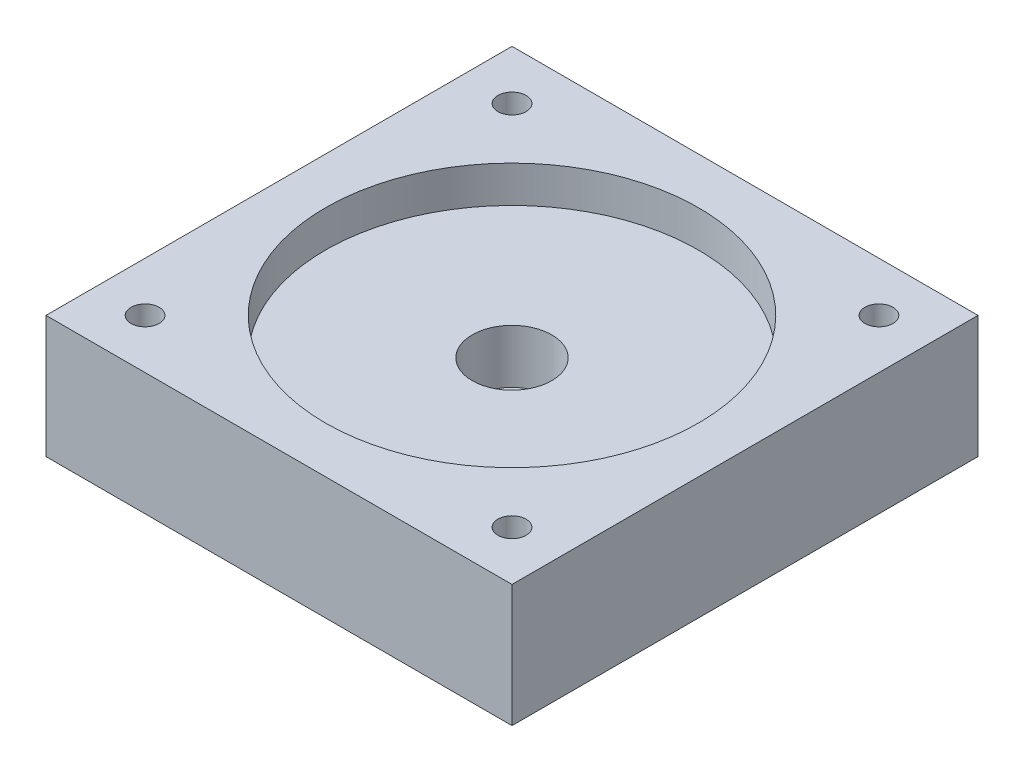
ISO-10303-21;
HEADER;
FILE_DESCRIPTION(('STEP AP214'),'2;1');
FILE_NAME('part.step','',(''),(''),'','','');
FILE_SCHEMA(('AUTOMOTIVE_DESIGN { 1 0 10303 214 1 1 1 1 }'));
ENDSEC;
DATA;
#1=APPLICATION_CONTEXT('core data for automotive mechanical design processes');
#2=APPLICATION_PROTOCOL_DEFINITION('international standard','automotive_design',2000,#1);
#3=PRODUCT_CONTEXT('',#1,'mechanical');
#4=PRODUCT('Part','Part','',(#3));
#5=PRODUCT_RELATED_PRODUCT_CATEGORY('part','',(#4));
#6=PRODUCT_DEFINITION_FORMATION('','',#4);
#7=PRODUCT_DEFINITION_CONTEXT('part definition',#1,'design');
#8=PRODUCT_DEFINITION('design','',#6,#7);
#9=PRODUCT_DEFINITION_SHAPE('','',#8);
#10=(LENGTH_UNIT() NAMED_UNIT(*) SI_UNIT(.MILLI.,.METRE.));
#11=(NAMED_UNIT(*) PLANE_ANGLE_UNIT() SI_UNIT($,.RADIAN.));
#12=(NAMED_UNIT(*) SI_UNIT($,.STERADIAN.) SOLID_ANGLE_UNIT());
#13=UNCERTAINTY_MEASURE_WITH_UNIT(LENGTH_MEASURE(1.E-05),#10,'distance_accuracy_value','');
#14=(GEOMETRIC_REPRESENTATION_CONTEXT(3) GLOBAL_UNCERTAINTY_ASSIGNED_CONTEXT((#13)) GLOBAL_UNIT_ASSIGNED_CONTEXT((#10,
#11,#12)) REPRESENTATION_CONTEXT('',''));
#15=CARTESIAN_POINT('',(0.,0.,0.));
#16=DIRECTION('',(0.,0.,1.));
#17=DIRECTION('',(1.,0.,0.));
#18=AXIS2_PLACEMENT_3D('',#15,#16,#17);
#19=CARTESIAN_POINT('',(-19.05,-10.,-19.05));
#20=DIRECTION('',(-1.,0.,0.));
#21=DIRECTION('',(0.,0.,1.));
#22=AXIS2_PLACEMENT_3D('',#19,#20,#21);
#23=PLANE('',#22);
#24=DIRECTION('',(0.,0.,1.));
#25=VECTOR('',#24,1.);
#26=CARTESIAN_POINT('',(-19.05,0.,-19.05));
#27=LINE('',#26,#25);
#28=CARTESIAN_POINT('',(-19.05,0.,-19.05));
#29=VERTEX_POINT('',#28);
#30=CARTESIAN_POINT('',(-19.05,0.,19.05));
#31=VERTEX_POINT('',#30);
#32=EDGE_CURVE('E111',#29,#31,#27,.T.);
#33=ORIENTED_EDGE('',*,*,#32,.F.);
#34=DIRECTION('',(0.,1.,0.));
#35=VECTOR('',#34,1.);
#36=CARTESIAN_POINT('',(-19.05,-10.,-19.05));
#37=LINE('',#36,#35);
#38=CARTESIAN_POINT('',(-19.05,-10.,-19.05));
#39=VERTEX_POINT('',#38);
#40=EDGE_CURVE('E11',#39,#29,#37,.T.);
#41=ORIENTED_EDGE('',*,*,#40,.F.);
#42=DIRECTION('',(0.,0.,1.));
#43=VECTOR('',#42,1.);
#44=CARTESIAN_POINT('',(-19.05,-10.,-19.05));
#45=LINE('',#44,#43);
#46=CARTESIAN_POINT('',(-19.05,-10.,19.05));
#47=VERTEX_POINT('',#46);
#48=EDGE_CURVE('E103',#39,#47,#45,.T.);
#49=ORIENTED_EDGE('',*,*,#48,.T.);
#50=DIRECTION('',(0.,1.,0.));
#51=VECTOR('',#50,1.);
#52=CARTESIAN_POINT('',(-19.05,-10.,19.05));
#53=LINE('',#52,#51);
#54=EDGE_CURVE('E42',#47,#31,#53,.T.);
#55=ORIENTED_EDGE('',*,*,#54,.T.);
#56=EDGE_LOOP('',(#33,#41,#49,#55));
#57=FACE_BOUND('',#56,.T.);
#58=ADVANCED_FACE('F39',(#57),#23,.T.);
#59=CARTESIAN_POINT('',(-19.05,-10.,-19.05));
#60=DIRECTION('',(0.,0.,1.));
#61=DIRECTION('',(1.,0.,0.));
#62=AXIS2_PLACEMENT_3D('',#59,#60,#61);
#63=PLANE('',#62);
#64=DIRECTION('',(1.,0.,0.));
#65=VECTOR('',#64,1.);
#66=CARTESIAN_POINT('',(-19.05,0.,-19.05));
#67=LINE('',#66,#65);
#68=CARTESIAN_POINT('',(19.05,0.,-19.05));
#69=VERTEX_POINT('',#68);
#70=EDGE_CURVE('E73',#29,#69,#67,.T.);
#71=ORIENTED_EDGE('',*,*,#70,.T.);
#72=DIRECTION('',(0.,1.,0.));
#73=VECTOR('',#72,1.);
#74=CARTESIAN_POINT('',(19.05,-10.,-19.05));
#75=LINE('',#74,#73);
#76=CARTESIAN_POINT('',(19.05,-10.,-19.05));
#77=VERTEX_POINT('',#76);
#78=EDGE_CURVE('E49',#77,#69,#75,.T.);
#79=ORIENTED_EDGE('',*,*,#78,.F.);
#80=DIRECTION('',(1.,0.,0.));
#81=VECTOR('',#80,1.);
#82=CARTESIAN_POINT('',(-19.05,-10.,-19.05));
#83=LINE('',#82,#81);
#84=EDGE_CURVE('E90',#39,#77,#83,.T.);
#85=ORIENTED_EDGE('',*,*,#84,.F.);
#86=ORIENTED_EDGE('',*,*,#40,.T.);
#87=EDGE_LOOP('',(#71,#79,#85,#86));
#88=FACE_BOUND('',#87,.T.);
#89=ADVANCED_FACE('F128',(#88),#63,.F.);
#90=CARTESIAN_POINT('',(19.05,-10.,-19.05));
#91=DIRECTION('',(-1.,0.,0.));
#92=DIRECTION('',(0.,0.,1.));
#93=AXIS2_PLACEMENT_3D('',#90,#91,#92);
#94=PLANE('',#93);
#95=DIRECTION('',(0.,0.,1.));
#96=VECTOR('',#95,1.);
#97=CARTESIAN_POINT('',(19.05,0.,-19.05));
#98=LINE('',#97,#96);
#99=CARTESIAN_POINT('',(19.05,0.,19.05));
#100=VERTEX_POINT('',#99);
#101=EDGE_CURVE('E98',#69,#100,#98,.T.);
#102=ORIENTED_EDGE('',*,*,#101,.T.);
#103=DIRECTION('',(0.,1.,0.));
#104=VECTOR('',#103,1.);
#105=CARTESIAN_POINT('',(19.05,-10.,19.05));
#106=LINE('',#105,#104);
#107=CARTESIAN_POINT('',(19.05,-10.,19.05));
#108=VERTEX_POINT('',#107);
#109=EDGE_CURVE('E95',#108,#100,#106,.T.);
#110=ORIENTED_EDGE('',*,*,#109,.F.);
#111=DIRECTION('',(0.,0.,1.));
#112=VECTOR('',#111,1.);
#113=CARTESIAN_POINT('',(19.05,-10.,-19.05));
#114=LINE('',#113,#112);
#115=EDGE_CURVE('E85',#77,#108,#114,.T.);
#116=ORIENTED_EDGE('',*,*,#115,.F.);
#117=ORIENTED_EDGE('',*,*,#78,.T.);
#118=EDGE_LOOP('',(#102,#110,#116,#117));
#119=FACE_BOUND('',#118,.T.);
#120=ADVANCED_FACE('F96',(#119),#94,.F.);
#121=CARTESIAN_POINT('',(-19.05,-10.,19.05));
#122=DIRECTION('',(0.,0.,1.));
#123=DIRECTION('',(1.,0.,0.));
#124=AXIS2_PLACEMENT_3D('',#121,#122,#123);
#125=PLANE('',#124);
#126=DIRECTION('',(1.,0.,0.));
#127=VECTOR('',#126,1.);
#128=CARTESIAN_POINT('',(-19.05,0.,19.05));
#129=LINE('',#128,#127);
#130=EDGE_CURVE('E115',#31,#100,#129,.T.);
#131=ORIENTED_EDGE('',*,*,#130,.F.);
#132=ORIENTED_EDGE('',*,*,#54,.F.);
#133=DIRECTION('',(1.,0.,0.));
#134=VECTOR('',#133,1.);
#135=CARTESIAN_POINT('',(-19.05,-10.,19.05));
#136=LINE('',#135,#134);
#137=EDGE_CURVE('E89',#47,#108,#136,.T.);
#138=ORIENTED_EDGE('',*,*,#137,.T.);
#139=ORIENTED_EDGE('',*,*,#109,.T.);
#140=EDGE_LOOP('',(#131,#132,#138,#139));
#141=FACE_BOUND('',#140,.T.);
#142=ADVANCED_FACE('F101',(#141),#125,.T.);
#143=CARTESIAN_POINT('',(0.,-10.,0.));
#144=DIRECTION('',(0.,1.,0.));
#145=DIRECTION('',(0.,0.,1.));
#146=AXIS2_PLACEMENT_3D('',#143,#144,#145);
#147=PLANE('',#146);
#148=CARTESIAN_POINT('',(0.,-10.,0.));
#149=DIRECTION('',(0.,1.,0.));
#150=DIRECTION('',(0.,0.,1.));
#151=AXIS2_PLACEMENT_3D('',#148,#149,#150);
#152=CIRCLE('',#151,1.75);
#153=CARTESIAN_POINT('',(0.,-10.,1.75));
#154=VERTEX_POINT('',#153);
#155=EDGE_CURVE('E193',#154,#154,#152,.T.);
#156=ORIENTED_EDGE('',*,*,#155,.T.);
#157=EDGE_LOOP('',(#156));
#158=FACE_BOUND('',#157,.T.);
#159=CARTESIAN_POINT('',(15.,-10.,15.));
#160=DIRECTION('',(0.,1.,0.));
#161=DIRECTION('',(0.,0.,1.));
#162=AXIS2_PLACEMENT_3D('',#159,#160,#161);
#163=CIRCLE('',#162,1.15);
#164=CARTESIAN_POINT('',(15.,-10.,16.15));
#165=VERTEX_POINT('',#164);
#166=EDGE_CURVE('E216',#165,#165,#163,.T.);
#167=ORIENTED_EDGE('',*,*,#166,.T.);
#168=EDGE_LOOP('',(#167));
#169=FACE_BOUND('',#168,.T.);
#170=CARTESIAN_POINT('',(-15.,-10.,15.));
#171=DIRECTION('',(0.,1.,0.));
#172=DIRECTION('',(0.,0.,1.));
#173=AXIS2_PLACEMENT_3D('',#170,#171,#172);
#174=CIRCLE('',#173,1.15);
#175=CARTESIAN_POINT('',(-15.,-10.,16.15));
#176=VERTEX_POINT('',#175);
#177=EDGE_CURVE('E224',#176,#176,#174,.T.);
#178=ORIENTED_EDGE('',*,*,#177,.T.);
#179=EDGE_LOOP('',(#178));
#180=FACE_BOUND('',#179,.T.);
#181=CARTESIAN_POINT('',(15.,-10.,-15.));
#182=DIRECTION('',(0.,1.,0.));
#183=DIRECTION('',(0.,0.,1.));
#184=AXIS2_PLACEMENT_3D('',#181,#182,#183);
#185=CIRCLE('',#184,1.15);
#186=CARTESIAN_POINT('',(15.,-10.,-13.85));
#187=VERTEX_POINT('',#186);
#188=EDGE_CURVE('E232',#187,#187,#185,.T.);
#189=ORIENTED_EDGE('',*,*,#188,.T.);
#190=EDGE_LOOP('',(#189));
#191=FACE_BOUND('',#190,.T.);
#192=CARTESIAN_POINT('',(-15.,-10.,-15.));
#193=DIRECTION('',(0.,1.,0.));
#194=DIRECTION('',(0.,0.,1.));
#195=AXIS2_PLACEMENT_3D('',#192,#193,#194);
#196=CIRCLE('',#195,1.15);
#197=CARTESIAN_POINT('',(-15.,-10.,-13.85));
#198=VERTEX_POINT('',#197);
#199=EDGE_CURVE('E116',#198,#198,#196,.T.);
#200=ORIENTED_EDGE('',*,*,#199,.T.);
#201=EDGE_LOOP('',(#200));
#202=FACE_BOUND('',#201,.T.);
#203=ORIENTED_EDGE('',*,*,#48,.F.);
#204=ORIENTED_EDGE('',*,*,#84,.T.);
#205=ORIENTED_EDGE('',*,*,#115,.T.);
#206=ORIENTED_EDGE('',*,*,#137,.F.);
#207=EDGE_LOOP('',(#203,#204,#205,#206));
#208=FACE_BOUND('',#207,.T.);
#209=ADVANCED_FACE('F88',(#158,#169,#180,#191,#202,#208),#147,.F.);
#210=CARTESIAN_POINT('',(0.,0.,0.));
#211=DIRECTION('',(0.,1.,0.));
#212=DIRECTION('',(0.,0.,1.));
#213=AXIS2_PLACEMENT_3D('',#210,#211,#212);
#214=PLANE('',#213);
#215=CARTESIAN_POINT('',(0.,0.,0.));
#216=DIRECTION('',(0.,1.,0.));
#217=DIRECTION('',(0.,0.,1.));
#218=AXIS2_PLACEMENT_3D('',#215,#216,#217);
#219=CIRCLE('',#218,15.25);
#220=CARTESIAN_POINT('',(0.,0.,15.25));
#221=VERTEX_POINT('',#220);
#222=EDGE_CURVE('E207',#221,#221,#219,.T.);
#223=ORIENTED_EDGE('',*,*,#222,.F.);
#224=EDGE_LOOP('',(#223));
#225=FACE_BOUND('',#224,.T.);
#226=CARTESIAN_POINT('',(15.,0.,15.));
#227=DIRECTION('',(0.,1.,0.));
#228=DIRECTION('',(0.,0.,1.));
#229=AXIS2_PLACEMENT_3D('',#226,#227,#228);
#230=CIRCLE('',#229,1.15);
#231=CARTESIAN_POINT('',(15.,0.,16.15));
#232=VERTEX_POINT('',#231);
#233=EDGE_CURVE('E212',#232,#232,#230,.T.);
#234=ORIENTED_EDGE('',*,*,#233,.F.);
#235=EDGE_LOOP('',(#234));
#236=FACE_BOUND('',#235,.T.);
#237=CARTESIAN_POINT('',(-15.,0.,15.));
#238=DIRECTION('',(0.,1.,0.));
#239=DIRECTION('',(0.,0.,1.));
#240=AXIS2_PLACEMENT_3D('',#237,#238,#239);
#241=CIRCLE('',#240,1.15);
#242=CARTESIAN_POINT('',(-15.,0.,16.15));
#243=VERTEX_POINT('',#242);
#244=EDGE_CURVE('E220',#243,#243,#241,.T.);
#245=ORIENTED_EDGE('',*,*,#244,.F.);
#246=EDGE_LOOP('',(#245));
#247=FACE_BOUND('',#246,.T.);
#248=CARTESIAN_POINT('',(15.,0.,-15.));
#249=DIRECTION('',(0.,1.,0.));
#250=DIRECTION('',(0.,0.,1.));
#251=AXIS2_PLACEMENT_3D('',#248,#249,#250);
#252=CIRCLE('',#251,1.15);
#253=CARTESIAN_POINT('',(15.,0.,-13.85));
#254=VERTEX_POINT('',#253);
#255=EDGE_CURVE('E228',#254,#254,#252,.T.);
#256=ORIENTED_EDGE('',*,*,#255,.F.);
#257=EDGE_LOOP('',(#256));
#258=FACE_BOUND('',#257,.T.);
#259=CARTESIAN_POINT('',(-15.,0.,-15.));
#260=DIRECTION('',(0.,1.,0.));
#261=DIRECTION('',(0.,0.,1.));
#262=AXIS2_PLACEMENT_3D('',#259,#260,#261);
#263=CIRCLE('',#262,1.15);
#264=CARTESIAN_POINT('',(-15.,0.,-13.85));
#265=VERTEX_POINT('',#264);
#266=EDGE_CURVE('E236',#265,#265,#263,.T.);
#267=ORIENTED_EDGE('',*,*,#266,.F.);
#268=EDGE_LOOP('',(#267));
#269=FACE_BOUND('',#268,.T.);
#270=ORIENTED_EDGE('',*,*,#32,.T.);
#271=ORIENTED_EDGE('',*,*,#130,.T.);
#272=ORIENTED_EDGE('',*,*,#101,.F.);
#273=ORIENTED_EDGE('',*,*,#70,.F.);
#274=EDGE_LOOP('',(#270,#271,#272,#273));
#275=FACE_BOUND('',#274,.T.);
#276=ADVANCED_FACE('F125',(#225,#236,#247,#258,#269,#275),#214,.T.);
#277=CARTESIAN_POINT('',(-15.,-10.,-15.));
#278=DIRECTION('',(0.,1.,0.));
#279=DIRECTION('',(0.,0.,1.));
#280=AXIS2_PLACEMENT_3D('',#277,#278,#279);
#281=CYLINDRICAL_SURFACE('',#280,1.15);
#282=ORIENTED_EDGE('',*,*,#199,.F.);
#283=EDGE_LOOP('',(#282));
#284=FACE_BOUND('',#283,.T.);
#285=ORIENTED_EDGE('',*,*,#266,.T.);
#286=EDGE_LOOP('',(#285));
#287=FACE_BOUND('',#286,.T.);
#288=ADVANCED_FACE('F147',(#284,#287),#281,.F.);
#289=CARTESIAN_POINT('',(15.,-10.,-15.));
#290=DIRECTION('',(0.,1.,0.));
#291=DIRECTION('',(0.,0.,1.));
#292=AXIS2_PLACEMENT_3D('',#289,#290,#291);
#293=CYLINDRICAL_SURFACE('',#292,1.15);
#294=ORIENTED_EDGE('',*,*,#188,.F.);
#295=EDGE_LOOP('',(#294));
#296=FACE_BOUND('',#295,.T.);
#297=ORIENTED_EDGE('',*,*,#255,.T.);
#298=EDGE_LOOP('',(#297));
#299=FACE_BOUND('',#298,.T.);
#300=ADVANCED_FACE('F154',(#296,#299),#293,.F.);
#301=CARTESIAN_POINT('',(-15.,-10.,15.));
#302=DIRECTION('',(0.,1.,0.));
#303=DIRECTION('',(0.,0.,1.));
#304=AXIS2_PLACEMENT_3D('',#301,#302,#303);
#305=CYLINDRICAL_SURFACE('',#304,1.15);
#306=ORIENTED_EDGE('',*,*,#177,.F.);
#307=EDGE_LOOP('',(#306));
#308=FACE_BOUND('',#307,.T.);
#309=ORIENTED_EDGE('',*,*,#244,.T.);
#310=EDGE_LOOP('',(#309));
#311=FACE_BOUND('',#310,.T.);
#312=ADVANCED_FACE('F158',(#308,#311),#305,.F.);
#313=CARTESIAN_POINT('',(15.,-10.,15.));
#314=DIRECTION('',(0.,1.,0.));
#315=DIRECTION('',(0.,0.,1.));
#316=AXIS2_PLACEMENT_3D('',#313,#314,#315);
#317=CYLINDRICAL_SURFACE('',#316,1.15);
#318=ORIENTED_EDGE('',*,*,#166,.F.);
#319=EDGE_LOOP('',(#318));
#320=FACE_BOUND('',#319,.T.);
#321=ORIENTED_EDGE('',*,*,#233,.T.);
#322=EDGE_LOOP('',(#321));
#323=FACE_BOUND('',#322,.T.);
#324=ADVANCED_FACE('F162',(#320,#323),#317,.F.);
#325=CARTESIAN_POINT('',(0.,-3.,0.));
#326=DIRECTION('',(0.,1.,0.));
#327=DIRECTION('',(0.,0.,1.));
#328=AXIS2_PLACEMENT_3D('',#325,#326,#327);
#329=CYLINDRICAL_SURFACE('',#328,15.25);
#330=CARTESIAN_POINT('',(0.,-3.,0.));
#331=DIRECTION('',(0.,1.,0.));
#332=DIRECTION('',(0.,0.,1.));
#333=AXIS2_PLACEMENT_3D('',#330,#331,#332);
#334=CIRCLE('',#333,15.25);
#335=CARTESIAN_POINT('',(0.,-3.,15.25));
#336=VERTEX_POINT('',#335);
#337=EDGE_CURVE('E208',#336,#336,#334,.T.);
#338=ORIENTED_EDGE('',*,*,#337,.F.);
#339=EDGE_LOOP('',(#338));
#340=FACE_BOUND('',#339,.T.);
#341=ORIENTED_EDGE('',*,*,#222,.T.);
#342=EDGE_LOOP('',(#341));
#343=FACE_BOUND('',#342,.T.);
#344=ADVANCED_FACE('F166',(#340,#343),#329,.F.);
#345=CARTESIAN_POINT('',(0.,-3.,0.));
#346=DIRECTION('',(0.,1.,0.));
#347=DIRECTION('',(0.,0.,1.));
#348=AXIS2_PLACEMENT_3D('',#345,#346,#347);
#349=PLANE('',#348);
#350=CARTESIAN_POINT('',(0.,-3.,0.));
#351=DIRECTION('',(0.,1.,0.));
#352=DIRECTION('',(0.,0.,1.));
#353=AXIS2_PLACEMENT_3D('',#350,#351,#352);
#354=CIRCLE('',#353,3.25);
#355=CARTESIAN_POINT('',(0.,-3.,3.25));
#356=VERTEX_POINT('',#355);
#357=EDGE_CURVE('E203',#356,#356,#354,.T.);
#358=ORIENTED_EDGE('',*,*,#357,.F.);
#359=EDGE_LOOP('',(#358));
#360=FACE_BOUND('',#359,.T.);
#361=ORIENTED_EDGE('',*,*,#337,.T.);
#362=EDGE_LOOP('',(#361));
#363=FACE_BOUND('',#362,.T.);
#364=ADVANCED_FACE('F170',(#360,#363),#349,.T.);
#365=CARTESIAN_POINT('',(0.,-7.4,0.));
#366=DIRECTION('',(0.,1.,0.));
#367=DIRECTION('',(0.,0.,1.));
#368=AXIS2_PLACEMENT_3D('',#365,#366,#367);
#369=CYLINDRICAL_SURFACE('',#368,3.25);
#370=ORIENTED_EDGE('',*,*,#357,.T.);
#371=EDGE_LOOP('',(#370));
#372=FACE_BOUND('',#371,.T.);
#373=CARTESIAN_POINT('',(0.,-7.4,0.));
#374=DIRECTION('',(0.,1.,0.));
#375=DIRECTION('',(0.,0.,1.));
#376=AXIS2_PLACEMENT_3D('',#373,#374,#375);
#377=CIRCLE('',#376,3.25);
#378=CARTESIAN_POINT('',(0.,-7.4,3.25));
#379=VERTEX_POINT('',#378);
#380=EDGE_CURVE('E197',#379,#379,#377,.T.);
#381=ORIENTED_EDGE('',*,*,#380,.F.);
#382=EDGE_LOOP('',(#381));
#383=FACE_BOUND('',#382,.T.);
#384=ADVANCED_FACE('F174',(#372,#383),#369,.F.);
#385=CARTESIAN_POINT('',(0.,-7.4,0.));
#386=DIRECTION('',(0.,1.,0.));
#387=DIRECTION('',(0.,0.,1.));
#388=AXIS2_PLACEMENT_3D('',#385,#386,#387);
#389=PLANE('',#388);
#390=CARTESIAN_POINT('',(0.,-7.4,0.));
#391=DIRECTION('',(0.,1.,0.));
#392=DIRECTION('',(0.,0.,1.));
#393=AXIS2_PLACEMENT_3D('',#390,#391,#392);
#394=CIRCLE('',#393,1.75);
#395=CARTESIAN_POINT('',(0.,-7.4,1.75));
#396=VERTEX_POINT('',#395);
#397=EDGE_CURVE('E191',#396,#396,#394,.T.);
#398=ORIENTED_EDGE('',*,*,#397,.F.);
#399=EDGE_LOOP('',(#398));
#400=FACE_BOUND('',#399,.T.);
#401=ORIENTED_EDGE('',*,*,#380,.T.);
#402=EDGE_LOOP('',(#401));
#403=FACE_BOUND('',#402,.T.);
#404=ADVANCED_FACE('F178',(#400,#403),#389,.T.);
#405=CARTESIAN_POINT('',(0.,-10.,0.));
#406=DIRECTION('',(0.,1.,0.));
#407=DIRECTION('',(0.,0.,1.));
#408=AXIS2_PLACEMENT_3D('',#405,#406,#407);
#409=CYLINDRICAL_SURFACE('',#408,1.75);
#410=ORIENTED_EDGE('',*,*,#397,.T.);
#411=EDGE_LOOP('',(#410));
#412=FACE_BOUND('',#411,.T.);
#413=ORIENTED_EDGE('',*,*,#155,.F.);
#414=EDGE_LOOP('',(#413));
#415=FACE_BOUND('',#414,.T.);
#416=ADVANCED_FACE('F182',(#412,#415),#409,.F.);
#417=CLOSED_SHELL('',(#58,#89,#120,#142,#209,#276,#288,#300,#312,#324,#344,#364,#384,#404,#416));
#418=MANIFOLD_SOLID_BREP('B2',#417);
#419=ADVANCED_BREP_SHAPE_REPRESENTATION('',(#18,#418),#14);
#420=SHAPE_DEFINITION_REPRESENTATION(#9,#419);
ENDSEC;
END-ISO-10303-21;
